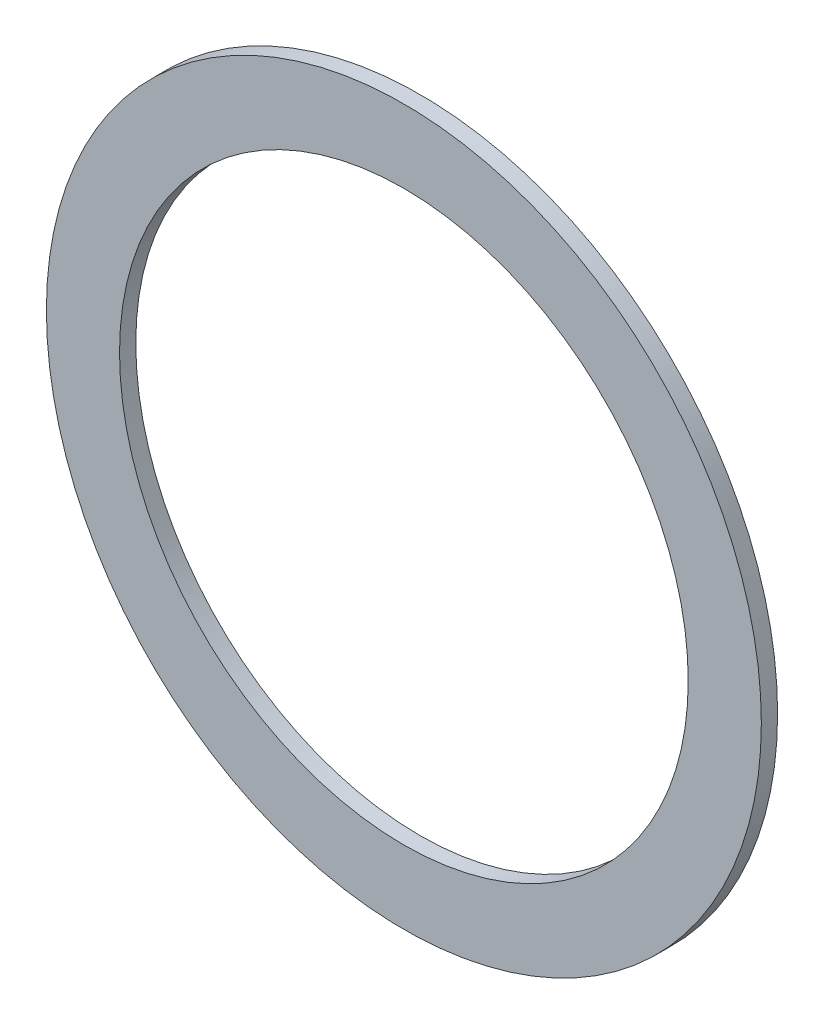
ISO-10303-21;
HEADER;
FILE_DESCRIPTION(('STEP AP214'),'2;1');
FILE_NAME('part.step','',(''),(''),'','','');
FILE_SCHEMA(('AUTOMOTIVE_DESIGN { 1 0 10303 214 1 1 1 1 }'));
ENDSEC;
DATA;
#1=APPLICATION_CONTEXT('core data for automotive mechanical design processes');
#2=APPLICATION_PROTOCOL_DEFINITION('international standard','automotive_design',2000,#1);
#3=PRODUCT_CONTEXT('',#1,'mechanical');
#4=PRODUCT('Part','Part','',(#3));
#5=PRODUCT_RELATED_PRODUCT_CATEGORY('part','',(#4));
#6=PRODUCT_DEFINITION_FORMATION('','',#4);
#7=PRODUCT_DEFINITION_CONTEXT('part definition',#1,'design');
#8=PRODUCT_DEFINITION('design','',#6,#7);
#9=PRODUCT_DEFINITION_SHAPE('','',#8);
#10=(LENGTH_UNIT() NAMED_UNIT(*) SI_UNIT(.MILLI.,.METRE.));
#11=(NAMED_UNIT(*) PLANE_ANGLE_UNIT() SI_UNIT($,.RADIAN.));
#12=(NAMED_UNIT(*) SI_UNIT($,.STERADIAN.) SOLID_ANGLE_UNIT());
#13=UNCERTAINTY_MEASURE_WITH_UNIT(LENGTH_MEASURE(1.E-05),#10,'distance_accuracy_value','');
#14=(GEOMETRIC_REPRESENTATION_CONTEXT(3) GLOBAL_UNCERTAINTY_ASSIGNED_CONTEXT((#13)) GLOBAL_UNIT_ASSIGNED_CONTEXT((#10,
#11,#12)) REPRESENTATION_CONTEXT('',''));
#15=CARTESIAN_POINT('',(0.,0.,0.));
#16=DIRECTION('',(0.,0.,1.));
#17=DIRECTION('',(1.,0.,0.));
#18=AXIS2_PLACEMENT_3D('',#15,#16,#17);
#19=CARTESIAN_POINT('',(0.,0.,1.));
#20=DIRECTION('',(0.,0.,1.));
#21=DIRECTION('',(1.,0.,0.));
#22=AXIS2_PLACEMENT_3D('',#19,#20,#21);
#23=PLANE('',#22);
#24=CARTESIAN_POINT('',(0.,0.,1.));
#25=DIRECTION('',(0.,0.,1.));
#26=DIRECTION('',(1.,0.,0.));
#27=AXIS2_PLACEMENT_3D('',#24,#25,#26);
#28=CIRCLE('',#27,22.);
#29=CARTESIAN_POINT('',(22.,0.,1.));
#30=VERTEX_POINT('',#29);
#31=EDGE_CURVE('E11',#30,#30,#28,.T.);
#32=ORIENTED_EDGE('',*,*,#31,.T.);
#33=EDGE_LOOP('',(#32));
#34=FACE_BOUND('',#33,.T.);
#35=CARTESIAN_POINT('',(0.,0.,1.));
#36=DIRECTION('',(0.,0.,1.));
#37=DIRECTION('',(1.,0.,0.));
#38=AXIS2_PLACEMENT_3D('',#35,#36,#37);
#39=CIRCLE('',#38,17.5);
#40=CARTESIAN_POINT('',(17.5,0.,1.));
#41=VERTEX_POINT('',#40);
#42=EDGE_CURVE('E47',#41,#41,#39,.T.);
#43=ORIENTED_EDGE('',*,*,#42,.F.);
#44=EDGE_LOOP('',(#43));
#45=FACE_BOUND('',#44,.T.);
#46=ADVANCED_FACE('F36',(#34,#45),#23,.T.);
#47=CARTESIAN_POINT('',(0.,0.,0.));
#48=DIRECTION('',(0.,0.,1.));
#49=DIRECTION('',(1.,0.,0.));
#50=AXIS2_PLACEMENT_3D('',#47,#48,#49);
#51=PLANE('',#50);
#52=CARTESIAN_POINT('',(0.,0.,0.));
#53=DIRECTION('',(0.,0.,1.));
#54=DIRECTION('',(1.,0.,0.));
#55=AXIS2_PLACEMENT_3D('',#52,#53,#54);
#56=CIRCLE('',#55,22.);
#57=CARTESIAN_POINT('',(22.,0.,0.));
#58=VERTEX_POINT('',#57);
#59=EDGE_CURVE('E40',#58,#58,#56,.T.);
#60=ORIENTED_EDGE('',*,*,#59,.F.);
#61=EDGE_LOOP('',(#60));
#62=FACE_BOUND('',#61,.T.);
#63=CARTESIAN_POINT('',(0.,0.,0.));
#64=DIRECTION('',(0.,0.,1.));
#65=DIRECTION('',(1.,0.,0.));
#66=AXIS2_PLACEMENT_3D('',#63,#64,#65);
#67=CIRCLE('',#66,17.5);
#68=CARTESIAN_POINT('',(17.5,0.,0.));
#69=VERTEX_POINT('',#68);
#70=EDGE_CURVE('E49',#69,#69,#67,.T.);
#71=ORIENTED_EDGE('',*,*,#70,.T.);
#72=EDGE_LOOP('',(#71));
#73=FACE_BOUND('',#72,.T.);
#74=ADVANCED_FACE('F59',(#62,#73),#51,.F.);
#75=CARTESIAN_POINT('',(0.,0.,1.));
#76=DIRECTION('',(0.,0.,-1.));
#77=DIRECTION('',(-1.,0.,0.));
#78=AXIS2_PLACEMENT_3D('',#75,#76,#77);
#79=CYLINDRICAL_SURFACE('',#78,22.);
#80=ORIENTED_EDGE('',*,*,#31,.F.);
#81=EDGE_LOOP('',(#80));
#82=FACE_BOUND('',#81,.T.);
#83=ORIENTED_EDGE('',*,*,#59,.T.);
#84=EDGE_LOOP('',(#83));
#85=FACE_BOUND('',#84,.T.);
#86=ADVANCED_FACE('F38',(#82,#85),#79,.T.);
#87=CARTESIAN_POINT('',(0.,0.,1.));
#88=DIRECTION('',(0.,0.,-1.));
#89=DIRECTION('',(-1.,0.,0.));
#90=AXIS2_PLACEMENT_3D('',#87,#88,#89);
#91=CYLINDRICAL_SURFACE('',#90,17.5);
#92=ORIENTED_EDGE('',*,*,#42,.T.);
#93=EDGE_LOOP('',(#92));
#94=FACE_BOUND('',#93,.T.);
#95=ORIENTED_EDGE('',*,*,#70,.F.);
#96=EDGE_LOOP('',(#95));
#97=FACE_BOUND('',#96,.T.);
#98=ADVANCED_FACE('F55',(#94,#97),#91,.F.);
#99=CLOSED_SHELL('',(#46,#74,#86,#98));
#100=MANIFOLD_SOLID_BREP('B2',#99);
#101=ADVANCED_BREP_SHAPE_REPRESENTATION('',(#18,#100),#14);
#102=SHAPE_DEFINITION_REPRESENTATION(#9,#101);
ENDSEC;
END-ISO-10303-21;
